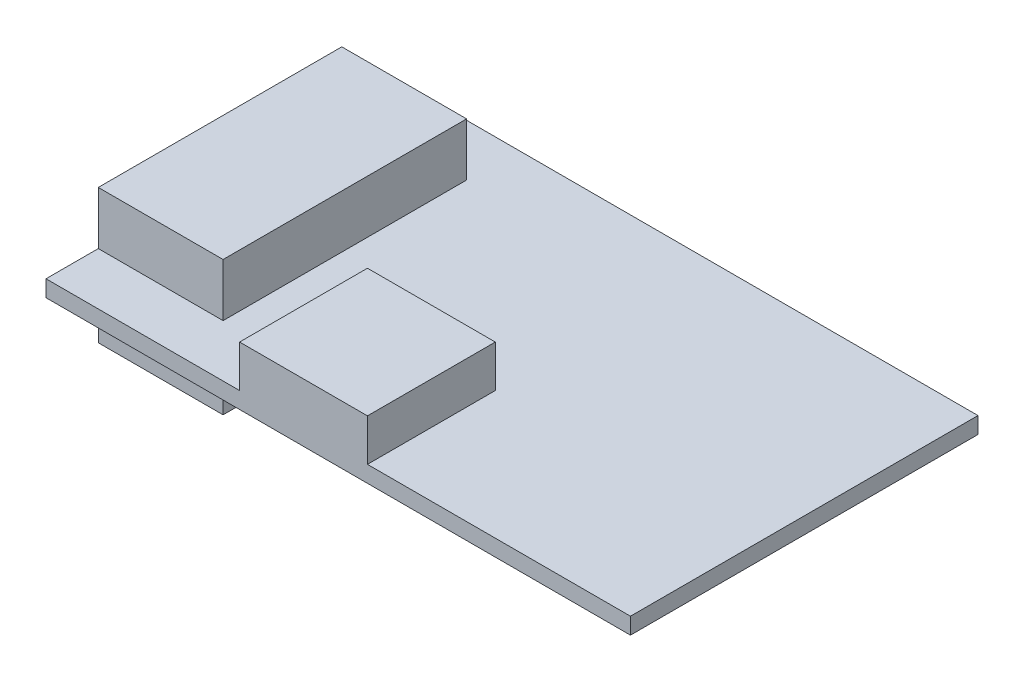
ISO-10303-21;
HEADER;
FILE_DESCRIPTION(('STEP AP214'),'2;1');
FILE_NAME('part.step','',(''),(''),'','','');
FILE_SCHEMA(('AUTOMOTIVE_DESIGN { 1 0 10303 214 1 1 1 1 }'));
ENDSEC;
DATA;
#1=APPLICATION_CONTEXT('core data for automotive mechanical design processes');
#2=APPLICATION_PROTOCOL_DEFINITION('international standard','automotive_design',2000,#1);
#3=PRODUCT_CONTEXT('',#1,'mechanical');
#4=PRODUCT('Part','Part','',(#3));
#5=PRODUCT_RELATED_PRODUCT_CATEGORY('part','',(#4));
#6=PRODUCT_DEFINITION_FORMATION('','',#4);
#7=PRODUCT_DEFINITION_CONTEXT('part definition',#1,'design');
#8=PRODUCT_DEFINITION('design','',#6,#7);
#9=PRODUCT_DEFINITION_SHAPE('','',#8);
#10=(LENGTH_UNIT() NAMED_UNIT(*) SI_UNIT(.MILLI.,.METRE.));
#11=(NAMED_UNIT(*) PLANE_ANGLE_UNIT() SI_UNIT($,.RADIAN.));
#12=(NAMED_UNIT(*) SI_UNIT($,.STERADIAN.) SOLID_ANGLE_UNIT());
#13=UNCERTAINTY_MEASURE_WITH_UNIT(LENGTH_MEASURE(1.E-05),#10,'distance_accuracy_value','');
#14=(GEOMETRIC_REPRESENTATION_CONTEXT(3) GLOBAL_UNCERTAINTY_ASSIGNED_CONTEXT((#13)) GLOBAL_UNIT_ASSIGNED_CONTEXT((#10,
#11,#12)) REPRESENTATION_CONTEXT('',''));
#15=CARTESIAN_POINT('',(0.,0.,0.));
#16=DIRECTION('',(0.,0.,1.));
#17=DIRECTION('',(1.,0.,0.));
#18=AXIS2_PLACEMENT_3D('',#15,#16,#17);
#19=CARTESIAN_POINT('',(0.,0.6858,0.));
#20=DIRECTION('',(0.,-1.,0.));
#21=DIRECTION('',(0.,0.,-1.));
#22=AXIS2_PLACEMENT_3D('',#19,#20,#21);
#23=PLANE('',#22);
#24=DIRECTION('',(0.,0.,1.));
#25=VECTOR('',#24,1.);
#26=CARTESIAN_POINT('',(8.0772,0.6858,-5.334));
#27=LINE('',#26,#25);
#28=CARTESIAN_POINT('',(8.0772,0.6858,-5.334));
#29=VERTEX_POINT('',#28);
#30=CARTESIAN_POINT('',(8.0772,0.6858,0.));
#31=VERTEX_POINT('',#30);
#32=EDGE_CURVE('E48',#29,#31,#27,.T.);
#33=ORIENTED_EDGE('',*,*,#32,.F.);
#34=DIRECTION('',(-1.,0.,0.));
#35=VECTOR('',#34,1.);
#36=CARTESIAN_POINT('',(8.0772,0.6858,-5.334));
#37=LINE('',#36,#35);
#38=CARTESIAN_POINT('',(13.4112,0.6858,-5.334));
#39=VERTEX_POINT('',#38);
#40=EDGE_CURVE('E52',#39,#29,#37,.T.);
#41=ORIENTED_EDGE('',*,*,#40,.F.);
#42=DIRECTION('',(0.,0.,-1.));
#43=VECTOR('',#42,1.);
#44=CARTESIAN_POINT('',(13.4112,0.6858,-5.334));
#45=LINE('',#44,#43);
#46=CARTESIAN_POINT('',(13.4112,0.6858,0.));
#47=VERTEX_POINT('',#46);
#48=EDGE_CURVE('E438',#47,#39,#45,.T.);
#49=ORIENTED_EDGE('',*,*,#48,.F.);
#50=DIRECTION('',(1.,0.,0.));
#51=VECTOR('',#50,1.);
#52=CARTESIAN_POINT('',(0.,0.6858,0.));
#53=LINE('',#52,#51);
#54=CARTESIAN_POINT('',(24.384,0.6858,0.));
#55=VERTEX_POINT('',#54);
#56=EDGE_CURVE('E235',#47,#55,#53,.T.);
#57=ORIENTED_EDGE('',*,*,#56,.T.);
#58=DIRECTION('',(0.,0.,-1.));
#59=VECTOR('',#58,1.);
#60=CARTESIAN_POINT('',(24.384,0.6858,0.));
#61=LINE('',#60,#59);
#62=CARTESIAN_POINT('',(24.384,0.6858,-14.5));
#63=VERTEX_POINT('',#62);
#64=EDGE_CURVE('E239',#55,#63,#61,.T.);
#65=ORIENTED_EDGE('',*,*,#64,.T.);
#66=DIRECTION('',(-1.,0.,0.));
#67=VECTOR('',#66,1.);
#68=CARTESIAN_POINT('',(0.,0.6858,-14.5));
#69=LINE('',#68,#67);
#70=CARTESIAN_POINT('',(0.,0.6858,-14.5));
#71=VERTEX_POINT('',#70);
#72=EDGE_CURVE('E241',#63,#71,#69,.T.);
#73=ORIENTED_EDGE('',*,*,#72,.T.);
#74=DIRECTION('',(0.,0.,1.));
#75=VECTOR('',#74,1.);
#76=CARTESIAN_POINT('',(0.,0.6858,0.));
#77=LINE('',#76,#75);
#78=CARTESIAN_POINT('',(0.,0.6858,-12.341));
#79=VERTEX_POINT('',#78);
#80=EDGE_CURVE('E233',#71,#79,#77,.T.);
#81=ORIENTED_EDGE('',*,*,#80,.T.);
#82=DIRECTION('',(-1.,0.,0.));
#83=VECTOR('',#82,1.);
#84=CARTESIAN_POINT('',(0.,0.6858,-12.341));
#85=LINE('',#84,#83);
#86=CARTESIAN_POINT('',(5.20699999999999,0.6858,-12.341));
#87=VERTEX_POINT('',#86);
#88=EDGE_CURVE('E207',#87,#79,#85,.T.);
#89=ORIENTED_EDGE('',*,*,#88,.F.);
#90=DIRECTION('',(0.,0.,-1.));
#91=VECTOR('',#90,1.);
#92=CARTESIAN_POINT('',(5.20699999999999,0.6858,-12.341));
#93=LINE('',#92,#91);
#94=CARTESIAN_POINT('',(5.20699999999999,0.6858,-2.181));
#95=VERTEX_POINT('',#94);
#96=EDGE_CURVE('E216',#95,#87,#93,.T.);
#97=ORIENTED_EDGE('',*,*,#96,.F.);
#98=DIRECTION('',(1.,0.,0.));
#99=VECTOR('',#98,1.);
#100=CARTESIAN_POINT('',(0.,0.6858,-2.181));
#101=LINE('',#100,#99);
#102=CARTESIAN_POINT('',(0.,0.6858,-2.181));
#103=VERTEX_POINT('',#102);
#104=EDGE_CURVE('E202',#103,#95,#101,.T.);
#105=ORIENTED_EDGE('',*,*,#104,.F.);
#106=CARTESIAN_POINT('',(0.,0.6858,0.));
#107=VERTEX_POINT('',#106);
#108=EDGE_CURVE('E236',#103,#107,#77,.T.);
#109=ORIENTED_EDGE('',*,*,#108,.T.);
#110=EDGE_CURVE('E237',#107,#31,#53,.T.);
#111=ORIENTED_EDGE('',*,*,#110,.T.);
#112=EDGE_LOOP('',(#33,#41,#49,#57,#65,#73,#81,#89,#97,#105,#109,#111));
#113=FACE_BOUND('',#112,.T.);
#114=ADVANCED_FACE('F33',(#113),#23,.F.);
#115=CARTESIAN_POINT('',(0.,0.6858,0.));
#116=DIRECTION('',(1.,0.,0.));
#117=DIRECTION('',(0.,0.,-1.));
#118=AXIS2_PLACEMENT_3D('',#115,#116,#117);
#119=PLANE('',#118);
#120=DIRECTION('',(0.,0.,1.));
#121=VECTOR('',#120,1.);
#122=CARTESIAN_POINT('',(0.,0.,0.));
#123=LINE('',#122,#121);
#124=CARTESIAN_POINT('',(0.,0.,-14.5));
#125=VERTEX_POINT('',#124);
#126=CARTESIAN_POINT('',(0.,0.,-12.341));
#127=VERTEX_POINT('',#126);
#128=EDGE_CURVE('E244',#125,#127,#123,.T.);
#129=ORIENTED_EDGE('',*,*,#128,.T.);
#130=DIRECTION('',(0.,1.,0.));
#131=VECTOR('',#130,1.);
#132=CARTESIAN_POINT('',(0.,-2.7178,-12.341));
#133=LINE('',#132,#131);
#134=CARTESIAN_POINT('',(0.,-2.7178,-12.341));
#135=VERTEX_POINT('',#134);
#136=EDGE_CURVE('E199',#135,#127,#133,.T.);
#137=ORIENTED_EDGE('',*,*,#136,.F.);
#138=DIRECTION('',(0.,0.,-1.));
#139=VECTOR('',#138,1.);
#140=CARTESIAN_POINT('',(0.,-2.7178,-2.181));
#141=LINE('',#140,#139);
#142=CARTESIAN_POINT('',(0.,-2.7178,-2.181));
#143=VERTEX_POINT('',#142);
#144=EDGE_CURVE('E176',#143,#135,#141,.T.);
#145=ORIENTED_EDGE('',*,*,#144,.F.);
#146=DIRECTION('',(0.,1.,0.));
#147=VECTOR('',#146,1.);
#148=CARTESIAN_POINT('',(0.,-2.7178,-2.181));
#149=LINE('',#148,#147);
#150=CARTESIAN_POINT('',(0.,0.,-2.181));
#151=VERTEX_POINT('',#150);
#152=EDGE_CURVE('E185',#143,#151,#149,.T.);
#153=ORIENTED_EDGE('',*,*,#152,.T.);
#154=CARTESIAN_POINT('',(0.,0.,0.));
#155=VERTEX_POINT('',#154);
#156=EDGE_CURVE('E232',#151,#155,#123,.T.);
#157=ORIENTED_EDGE('',*,*,#156,.T.);
#158=DIRECTION('',(0.,-1.,0.));
#159=VECTOR('',#158,1.);
#160=CARTESIAN_POINT('',(0.,0.6858,0.));
#161=LINE('',#160,#159);
#162=EDGE_CURVE('E11',#107,#155,#161,.T.);
#163=ORIENTED_EDGE('',*,*,#162,.F.);
#164=ORIENTED_EDGE('',*,*,#108,.F.);
#165=DIRECTION('',(0.,-1.,0.));
#166=VECTOR('',#165,1.);
#167=CARTESIAN_POINT('',(0.,2.8956,-2.181));
#168=LINE('',#167,#166);
#169=CARTESIAN_POINT('',(0.,2.8956,-2.181));
#170=VERTEX_POINT('',#169);
#171=EDGE_CURVE('E229',#170,#103,#168,.T.);
#172=ORIENTED_EDGE('',*,*,#171,.F.);
#173=DIRECTION('',(0.,0.,1.));
#174=VECTOR('',#173,1.);
#175=CARTESIAN_POINT('',(0.,2.8956,-12.341));
#176=LINE('',#175,#174);
#177=CARTESIAN_POINT('',(0.,2.8956,-12.341));
#178=VERTEX_POINT('',#177);
#179=EDGE_CURVE('E203',#178,#170,#176,.T.);
#180=ORIENTED_EDGE('',*,*,#179,.F.);
#181=DIRECTION('',(0.,-1.,0.));
#182=VECTOR('',#181,1.);
#183=CARTESIAN_POINT('',(0.,2.8956,-12.341));
#184=LINE('',#183,#182);
#185=EDGE_CURVE('E213',#178,#79,#184,.T.);
#186=ORIENTED_EDGE('',*,*,#185,.T.);
#187=ORIENTED_EDGE('',*,*,#80,.F.);
#188=DIRECTION('',(0.,-1.,0.));
#189=VECTOR('',#188,1.);
#190=CARTESIAN_POINT('',(0.,0.6858,-14.5));
#191=LINE('',#190,#189);
#192=EDGE_CURVE('E243',#71,#125,#191,.T.);
#193=ORIENTED_EDGE('',*,*,#192,.T.);
#194=EDGE_LOOP('',(#129,#137,#145,#153,#157,#163,#164,#172,#180,#186,#187,#193));
#195=FACE_BOUND('',#194,.T.);
#196=ADVANCED_FACE('F35',(#195),#119,.F.);
#197=CARTESIAN_POINT('',(0.,0.6858,0.));
#198=DIRECTION('',(0.,0.,-1.));
#199=DIRECTION('',(-1.,0.,0.));
#200=AXIS2_PLACEMENT_3D('',#197,#198,#199);
#201=PLANE('',#200);
#202=DIRECTION('',(1.,0.,0.));
#203=VECTOR('',#202,1.);
#204=CARTESIAN_POINT('',(0.,0.,0.));
#205=LINE('',#204,#203);
#206=CARTESIAN_POINT('',(24.384,0.,0.));
#207=VERTEX_POINT('',#206);
#208=EDGE_CURVE('E247',#155,#207,#205,.T.);
#209=ORIENTED_EDGE('',*,*,#208,.T.);
#210=DIRECTION('',(0.,-1.,0.));
#211=VECTOR('',#210,1.);
#212=CARTESIAN_POINT('',(24.384,0.6858,0.));
#213=LINE('',#212,#211);
#214=EDGE_CURVE('E41',#55,#207,#213,.T.);
#215=ORIENTED_EDGE('',*,*,#214,.F.);
#216=ORIENTED_EDGE('',*,*,#56,.F.);
#217=DIRECTION('',(0.,-1.,0.));
#218=VECTOR('',#217,1.);
#219=CARTESIAN_POINT('',(13.4112,2.4384,0.));
#220=LINE('',#219,#218);
#221=CARTESIAN_POINT('',(13.4112,2.4384,0.));
#222=VERTEX_POINT('',#221);
#223=EDGE_CURVE('E152',#222,#47,#220,.T.);
#224=ORIENTED_EDGE('',*,*,#223,.F.);
#225=DIRECTION('',(1.,0.,0.));
#226=VECTOR('',#225,1.);
#227=CARTESIAN_POINT('',(8.0772,2.4384,0.));
#228=LINE('',#227,#226);
#229=CARTESIAN_POINT('',(8.0772,2.4384,0.));
#230=VERTEX_POINT('',#229);
#231=EDGE_CURVE('E145',#230,#222,#228,.T.);
#232=ORIENTED_EDGE('',*,*,#231,.F.);
#233=DIRECTION('',(0.,-1.,0.));
#234=VECTOR('',#233,1.);
#235=CARTESIAN_POINT('',(8.0772,2.4384,0.));
#236=LINE('',#235,#234);
#237=EDGE_CURVE('E150',#230,#31,#236,.T.);
#238=ORIENTED_EDGE('',*,*,#237,.T.);
#239=ORIENTED_EDGE('',*,*,#110,.F.);
#240=ORIENTED_EDGE('',*,*,#162,.T.);
#241=EDGE_LOOP('',(#209,#215,#216,#224,#232,#238,#239,#240));
#242=FACE_BOUND('',#241,.T.);
#243=ADVANCED_FACE('F147',(#242),#201,.F.);
#244=CARTESIAN_POINT('',(24.384,0.6858,0.));
#245=DIRECTION('',(-1.,0.,0.));
#246=DIRECTION('',(0.,0.,1.));
#247=AXIS2_PLACEMENT_3D('',#244,#245,#246);
#248=PLANE('',#247);
#249=DIRECTION('',(0.,0.,-1.));
#250=VECTOR('',#249,1.);
#251=CARTESIAN_POINT('',(24.384,0.,0.));
#252=LINE('',#251,#250);
#253=CARTESIAN_POINT('',(24.384,0.,-14.5));
#254=VERTEX_POINT('',#253);
#255=EDGE_CURVE('E249',#207,#254,#252,.T.);
#256=ORIENTED_EDGE('',*,*,#255,.T.);
#257=DIRECTION('',(0.,-1.,0.));
#258=VECTOR('',#257,1.);
#259=CARTESIAN_POINT('',(24.384,0.6858,-14.5));
#260=LINE('',#259,#258);
#261=EDGE_CURVE('E255',#63,#254,#260,.T.);
#262=ORIENTED_EDGE('',*,*,#261,.F.);
#263=ORIENTED_EDGE('',*,*,#64,.F.);
#264=ORIENTED_EDGE('',*,*,#214,.T.);
#265=EDGE_LOOP('',(#256,#262,#263,#264));
#266=FACE_BOUND('',#265,.T.);
#267=ADVANCED_FACE('F262',(#266),#248,.F.);
#268=CARTESIAN_POINT('',(0.,0.6858,-14.5));
#269=DIRECTION('',(0.,0.,1.));
#270=DIRECTION('',(1.,0.,0.));
#271=AXIS2_PLACEMENT_3D('',#268,#269,#270);
#272=PLANE('',#271);
#273=DIRECTION('',(-1.,0.,0.));
#274=VECTOR('',#273,1.);
#275=CARTESIAN_POINT('',(0.,0.,-14.5));
#276=LINE('',#275,#274);
#277=EDGE_CURVE('E251',#254,#125,#276,.T.);
#278=ORIENTED_EDGE('',*,*,#277,.T.);
#279=ORIENTED_EDGE('',*,*,#192,.F.);
#280=ORIENTED_EDGE('',*,*,#72,.F.);
#281=ORIENTED_EDGE('',*,*,#261,.T.);
#282=EDGE_LOOP('',(#278,#279,#280,#281));
#283=FACE_BOUND('',#282,.T.);
#284=ADVANCED_FACE('F271',(#283),#272,.F.);
#285=CARTESIAN_POINT('',(0.,0.,0.));
#286=DIRECTION('',(0.,-1.,0.));
#287=DIRECTION('',(0.,0.,-1.));
#288=AXIS2_PLACEMENT_3D('',#285,#286,#287);
#289=PLANE('',#288);
#290=DIRECTION('',(-1.,0.,0.));
#291=VECTOR('',#290,1.);
#292=CARTESIAN_POINT('',(0.,0.,-2.181));
#293=LINE('',#292,#291);
#294=CARTESIAN_POINT('',(5.20699999999999,0.,-2.181));
#295=VERTEX_POINT('',#294);
#296=EDGE_CURVE('E180',#295,#151,#293,.T.);
#297=ORIENTED_EDGE('',*,*,#296,.F.);
#298=DIRECTION('',(0.,0.,1.));
#299=VECTOR('',#298,1.);
#300=CARTESIAN_POINT('',(5.20699999999999,0.,-2.181));
#301=LINE('',#300,#299);
#302=CARTESIAN_POINT('',(5.20699999999999,0.,-12.341));
#303=VERTEX_POINT('',#302);
#304=EDGE_CURVE('E170',#303,#295,#301,.T.);
#305=ORIENTED_EDGE('',*,*,#304,.F.);
#306=DIRECTION('',(1.,0.,0.));
#307=VECTOR('',#306,1.);
#308=CARTESIAN_POINT('',(0.,0.,-12.341));
#309=LINE('',#308,#307);
#310=EDGE_CURVE('E167',#127,#303,#309,.T.);
#311=ORIENTED_EDGE('',*,*,#310,.F.);
#312=ORIENTED_EDGE('',*,*,#128,.F.);
#313=ORIENTED_EDGE('',*,*,#277,.F.);
#314=ORIENTED_EDGE('',*,*,#255,.F.);
#315=ORIENTED_EDGE('',*,*,#208,.F.);
#316=ORIENTED_EDGE('',*,*,#156,.F.);
#317=EDGE_LOOP('',(#297,#305,#311,#312,#313,#314,#315,#316));
#318=FACE_BOUND('',#317,.T.);
#319=ADVANCED_FACE('F267',(#318),#289,.T.);
#320=CARTESIAN_POINT('',(0.,2.8956,-2.181));
#321=DIRECTION('',(0.,0.,-1.));
#322=DIRECTION('',(-1.,0.,0.));
#323=AXIS2_PLACEMENT_3D('',#320,#321,#322);
#324=PLANE('',#323);
#325=ORIENTED_EDGE('',*,*,#104,.T.);
#326=DIRECTION('',(0.,-1.,0.));
#327=VECTOR('',#326,1.);
#328=CARTESIAN_POINT('',(5.20699999999999,2.8956,-2.181));
#329=LINE('',#328,#327);
#330=CARTESIAN_POINT('',(5.20699999999999,2.8956,-2.181));
#331=VERTEX_POINT('',#330);
#332=EDGE_CURVE('E226',#331,#95,#329,.T.);
#333=ORIENTED_EDGE('',*,*,#332,.F.);
#334=DIRECTION('',(1.,0.,0.));
#335=VECTOR('',#334,1.);
#336=CARTESIAN_POINT('',(0.,2.8956,-2.181));
#337=LINE('',#336,#335);
#338=EDGE_CURVE('E206',#170,#331,#337,.T.);
#339=ORIENTED_EDGE('',*,*,#338,.F.);
#340=ORIENTED_EDGE('',*,*,#171,.T.);
#341=EDGE_LOOP('',(#325,#333,#339,#340));
#342=FACE_BOUND('',#341,.T.);
#343=ADVANCED_FACE('F288',(#342),#324,.F.);
#344=CARTESIAN_POINT('',(5.20699999999999,2.8956,-12.341));
#345=DIRECTION('',(-1.,0.,0.));
#346=DIRECTION('',(0.,0.,1.));
#347=AXIS2_PLACEMENT_3D('',#344,#345,#346);
#348=PLANE('',#347);
#349=ORIENTED_EDGE('',*,*,#96,.T.);
#350=DIRECTION('',(0.,-1.,0.));
#351=VECTOR('',#350,1.);
#352=CARTESIAN_POINT('',(5.20699999999999,2.8956,-12.341));
#353=LINE('',#352,#351);
#354=CARTESIAN_POINT('',(5.20699999999999,2.8956,-12.341));
#355=VERTEX_POINT('',#354);
#356=EDGE_CURVE('E223',#355,#87,#353,.T.);
#357=ORIENTED_EDGE('',*,*,#356,.F.);
#358=DIRECTION('',(0.,0.,-1.));
#359=VECTOR('',#358,1.);
#360=CARTESIAN_POINT('',(5.20699999999999,2.8956,-12.341));
#361=LINE('',#360,#359);
#362=EDGE_CURVE('E209',#331,#355,#361,.T.);
#363=ORIENTED_EDGE('',*,*,#362,.F.);
#364=ORIENTED_EDGE('',*,*,#332,.T.);
#365=EDGE_LOOP('',(#349,#357,#363,#364));
#366=FACE_BOUND('',#365,.T.);
#367=ADVANCED_FACE('F284',(#366),#348,.F.);
#368=CARTESIAN_POINT('',(0.,2.8956,-12.341));
#369=DIRECTION('',(0.,0.,1.));
#370=DIRECTION('',(1.,0.,0.));
#371=AXIS2_PLACEMENT_3D('',#368,#369,#370);
#372=PLANE('',#371);
#373=ORIENTED_EDGE('',*,*,#88,.T.);
#374=ORIENTED_EDGE('',*,*,#185,.F.);
#375=DIRECTION('',(-1.,0.,0.));
#376=VECTOR('',#375,1.);
#377=CARTESIAN_POINT('',(0.,2.8956,-12.341));
#378=LINE('',#377,#376);
#379=EDGE_CURVE('E211',#355,#178,#378,.T.);
#380=ORIENTED_EDGE('',*,*,#379,.F.);
#381=ORIENTED_EDGE('',*,*,#356,.T.);
#382=EDGE_LOOP('',(#373,#374,#380,#381));
#383=FACE_BOUND('',#382,.T.);
#384=ADVANCED_FACE('F279',(#383),#372,.F.);
#385=CARTESIAN_POINT('',(0.,2.8956,0.));
#386=DIRECTION('',(0.,1.,0.));
#387=DIRECTION('',(0.,0.,1.));
#388=AXIS2_PLACEMENT_3D('',#385,#386,#387);
#389=PLANE('',#388);
#390=ORIENTED_EDGE('',*,*,#179,.T.);
#391=ORIENTED_EDGE('',*,*,#338,.T.);
#392=ORIENTED_EDGE('',*,*,#362,.T.);
#393=ORIENTED_EDGE('',*,*,#379,.T.);
#394=EDGE_LOOP('',(#390,#391,#392,#393));
#395=FACE_BOUND('',#394,.T.);
#396=ADVANCED_FACE('F362',(#395),#389,.T.);
#397=CARTESIAN_POINT('',(0.,-2.7178,-12.341));
#398=DIRECTION('',(0.,0.,1.));
#399=DIRECTION('',(1.,0.,0.));
#400=AXIS2_PLACEMENT_3D('',#397,#398,#399);
#401=PLANE('',#400);
#402=ORIENTED_EDGE('',*,*,#310,.T.);
#403=DIRECTION('',(0.,1.,0.));
#404=VECTOR('',#403,1.);
#405=CARTESIAN_POINT('',(5.20699999999999,-2.7178,-12.341));
#406=LINE('',#405,#404);
#407=CARTESIAN_POINT('',(5.20699999999999,-2.7178,-12.341));
#408=VERTEX_POINT('',#407);
#409=EDGE_CURVE('E196',#408,#303,#406,.T.);
#410=ORIENTED_EDGE('',*,*,#409,.F.);
#411=DIRECTION('',(1.,0.,0.));
#412=VECTOR('',#411,1.);
#413=CARTESIAN_POINT('',(0.,-2.7178,-12.341));
#414=LINE('',#413,#412);
#415=EDGE_CURVE('E179',#135,#408,#414,.T.);
#416=ORIENTED_EDGE('',*,*,#415,.F.);
#417=ORIENTED_EDGE('',*,*,#136,.T.);
#418=EDGE_LOOP('',(#402,#410,#416,#417));
#419=FACE_BOUND('',#418,.T.);
#420=ADVANCED_FACE('F302',(#419),#401,.F.);
#421=CARTESIAN_POINT('',(5.20699999999999,-2.7178,-2.181));
#422=DIRECTION('',(-1.,0.,0.));
#423=DIRECTION('',(0.,0.,1.));
#424=AXIS2_PLACEMENT_3D('',#421,#422,#423);
#425=PLANE('',#424);
#426=ORIENTED_EDGE('',*,*,#304,.T.);
#427=DIRECTION('',(0.,1.,0.));
#428=VECTOR('',#427,1.);
#429=CARTESIAN_POINT('',(5.20699999999999,-2.7178,-2.181));
#430=LINE('',#429,#428);
#431=CARTESIAN_POINT('',(5.20699999999999,-2.7178,-2.181));
#432=VERTEX_POINT('',#431);
#433=EDGE_CURVE('E193',#432,#295,#430,.T.);
#434=ORIENTED_EDGE('',*,*,#433,.F.);
#435=DIRECTION('',(0.,0.,1.));
#436=VECTOR('',#435,1.);
#437=CARTESIAN_POINT('',(5.20699999999999,-2.7178,-2.181));
#438=LINE('',#437,#436);
#439=EDGE_CURVE('E182',#408,#432,#438,.T.);
#440=ORIENTED_EDGE('',*,*,#439,.F.);
#441=ORIENTED_EDGE('',*,*,#409,.T.);
#442=EDGE_LOOP('',(#426,#434,#440,#441));
#443=FACE_BOUND('',#442,.T.);
#444=ADVANCED_FACE('F299',(#443),#425,.F.);
#445=CARTESIAN_POINT('',(0.,-2.7178,-2.181));
#446=DIRECTION('',(0.,0.,-1.));
#447=DIRECTION('',(-1.,0.,0.));
#448=AXIS2_PLACEMENT_3D('',#445,#446,#447);
#449=PLANE('',#448);
#450=ORIENTED_EDGE('',*,*,#296,.T.);
#451=ORIENTED_EDGE('',*,*,#152,.F.);
#452=DIRECTION('',(-1.,0.,0.));
#453=VECTOR('',#452,1.);
#454=CARTESIAN_POINT('',(0.,-2.7178,-2.181));
#455=LINE('',#454,#453);
#456=EDGE_CURVE('E184',#432,#143,#455,.T.);
#457=ORIENTED_EDGE('',*,*,#456,.F.);
#458=ORIENTED_EDGE('',*,*,#433,.T.);
#459=EDGE_LOOP('',(#450,#451,#457,#458));
#460=FACE_BOUND('',#459,.T.);
#461=ADVANCED_FACE('F294',(#460),#449,.F.);
#462=CARTESIAN_POINT('',(0.,-2.7178,0.));
#463=DIRECTION('',(0.,-1.,0.));
#464=DIRECTION('',(0.,0.,-1.));
#465=AXIS2_PLACEMENT_3D('',#462,#463,#464);
#466=PLANE('',#465);
#467=ORIENTED_EDGE('',*,*,#144,.T.);
#468=ORIENTED_EDGE('',*,*,#415,.T.);
#469=ORIENTED_EDGE('',*,*,#439,.T.);
#470=ORIENTED_EDGE('',*,*,#456,.T.);
#471=EDGE_LOOP('',(#467,#468,#469,#470));
#472=FACE_BOUND('',#471,.T.);
#473=ADVANCED_FACE('F304',(#472),#466,.T.);
#474=CARTESIAN_POINT('',(8.0772,2.4384,-5.334));
#475=DIRECTION('',(1.,0.,0.));
#476=DIRECTION('',(0.,0.,-1.));
#477=AXIS2_PLACEMENT_3D('',#474,#475,#476);
#478=PLANE('',#477);
#479=ORIENTED_EDGE('',*,*,#32,.T.);
#480=ORIENTED_EDGE('',*,*,#237,.F.);
#481=DIRECTION('',(0.,0.,1.));
#482=VECTOR('',#481,1.);
#483=CARTESIAN_POINT('',(8.0772,2.4384,-5.334));
#484=LINE('',#483,#482);
#485=CARTESIAN_POINT('',(8.0772,2.4384,-5.334));
#486=VERTEX_POINT('',#485);
#487=EDGE_CURVE('E156',#486,#230,#484,.T.);
#488=ORIENTED_EDGE('',*,*,#487,.F.);
#489=DIRECTION('',(0.,-1.,0.));
#490=VECTOR('',#489,1.);
#491=CARTESIAN_POINT('',(8.0772,2.4384,-5.334));
#492=LINE('',#491,#490);
#493=EDGE_CURVE('E436',#486,#29,#492,.T.);
#494=ORIENTED_EDGE('',*,*,#493,.T.);
#495=EDGE_LOOP('',(#479,#480,#488,#494));
#496=FACE_BOUND('',#495,.T.);
#497=ADVANCED_FACE('F166',(#496),#478,.F.);
#498=CARTESIAN_POINT('',(13.4112,2.4384,-5.334));
#499=DIRECTION('',(-1.,0.,0.));
#500=DIRECTION('',(0.,0.,1.));
#501=AXIS2_PLACEMENT_3D('',#498,#499,#500);
#502=PLANE('',#501);
#503=ORIENTED_EDGE('',*,*,#48,.T.);
#504=DIRECTION('',(0.,-1.,0.));
#505=VECTOR('',#504,1.);
#506=CARTESIAN_POINT('',(13.4112,2.4384,-5.334));
#507=LINE('',#506,#505);
#508=CARTESIAN_POINT('',(13.4112,2.4384,-5.334));
#509=VERTEX_POINT('',#508);
#510=EDGE_CURVE('E172',#509,#39,#507,.T.);
#511=ORIENTED_EDGE('',*,*,#510,.F.);
#512=DIRECTION('',(0.,0.,-1.));
#513=VECTOR('',#512,1.);
#514=CARTESIAN_POINT('',(13.4112,2.4384,-5.334));
#515=LINE('',#514,#513);
#516=EDGE_CURVE('E155',#222,#509,#515,.T.);
#517=ORIENTED_EDGE('',*,*,#516,.F.);
#518=ORIENTED_EDGE('',*,*,#223,.T.);
#519=EDGE_LOOP('',(#503,#511,#517,#518));
#520=FACE_BOUND('',#519,.T.);
#521=ADVANCED_FACE('F311',(#520),#502,.F.);
#522=CARTESIAN_POINT('',(8.0772,2.4384,-5.334));
#523=DIRECTION('',(0.,0.,1.));
#524=DIRECTION('',(1.,0.,0.));
#525=AXIS2_PLACEMENT_3D('',#522,#523,#524);
#526=PLANE('',#525);
#527=ORIENTED_EDGE('',*,*,#40,.T.);
#528=ORIENTED_EDGE('',*,*,#493,.F.);
#529=DIRECTION('',(-1.,0.,0.));
#530=VECTOR('',#529,1.);
#531=CARTESIAN_POINT('',(8.0772,2.4384,-5.334));
#532=LINE('',#531,#530);
#533=EDGE_CURVE('E161',#509,#486,#532,.T.);
#534=ORIENTED_EDGE('',*,*,#533,.F.);
#535=ORIENTED_EDGE('',*,*,#510,.T.);
#536=EDGE_LOOP('',(#527,#528,#534,#535));
#537=FACE_BOUND('',#536,.T.);
#538=ADVANCED_FACE('F413',(#537),#526,.F.);
#539=CARTESIAN_POINT('',(0.,2.4384,0.));
#540=DIRECTION('',(0.,1.,0.));
#541=DIRECTION('',(0.,0.,1.));
#542=AXIS2_PLACEMENT_3D('',#539,#540,#541);
#543=PLANE('',#542);
#544=ORIENTED_EDGE('',*,*,#487,.T.);
#545=ORIENTED_EDGE('',*,*,#231,.T.);
#546=ORIENTED_EDGE('',*,*,#516,.T.);
#547=ORIENTED_EDGE('',*,*,#533,.T.);
#548=EDGE_LOOP('',(#544,#545,#546,#547));
#549=FACE_BOUND('',#548,.T.);
#550=ADVANCED_FACE('F159',(#549),#543,.T.);
#551=CLOSED_SHELL('',(#114,#196,#243,#267,#284,#319,#343,#367,#384,#396,#420,#444,#461,#473,
#497,#521,#538,#550));
#552=MANIFOLD_SOLID_BREP('B2',#551);
#553=ADVANCED_BREP_SHAPE_REPRESENTATION('',(#18,#552),#14);
#554=SHAPE_DEFINITION_REPRESENTATION(#9,#553);
ENDSEC;
END-ISO-10303-21;
